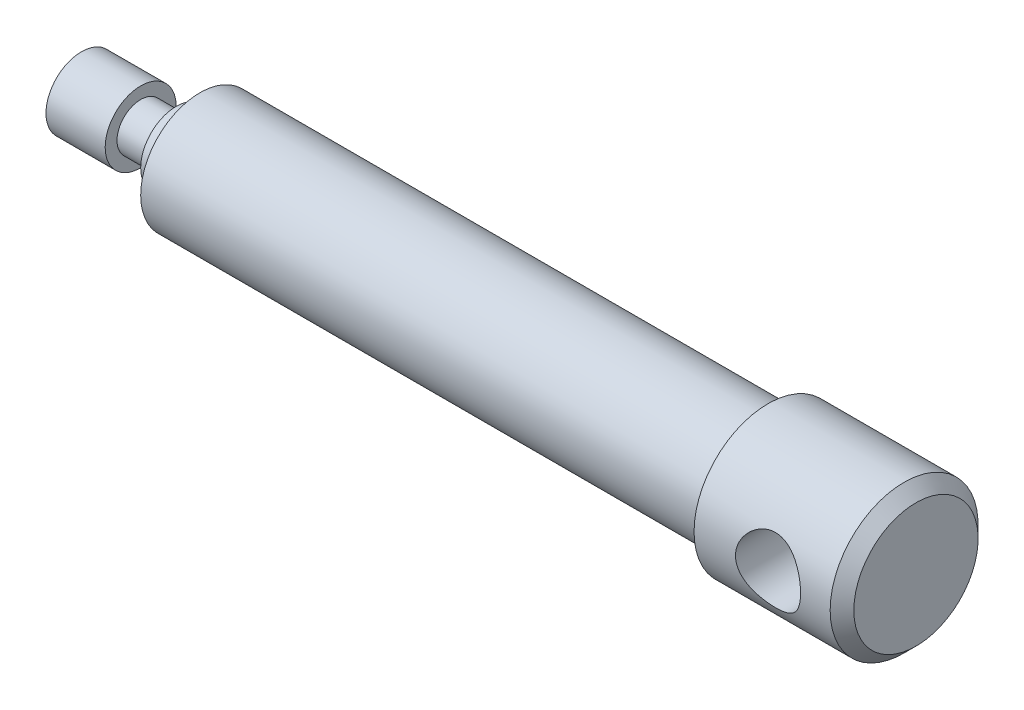
ISO-10303-21;
HEADER;
FILE_DESCRIPTION(('STEP AP214'),'2;1');
FILE_NAME('part.step','',(''),(''),'','','');
FILE_SCHEMA(('AUTOMOTIVE_DESIGN { 1 0 10303 214 1 1 1 1 }'));
ENDSEC;
DATA;
#1=APPLICATION_CONTEXT('core data for automotive mechanical design processes');
#2=APPLICATION_PROTOCOL_DEFINITION('international standard','automotive_design',2000,#1);
#3=PRODUCT_CONTEXT('',#1,'mechanical');
#4=PRODUCT('Part','Part','',(#3));
#5=PRODUCT_RELATED_PRODUCT_CATEGORY('part','',(#4));
#6=PRODUCT_DEFINITION_FORMATION('','',#4);
#7=PRODUCT_DEFINITION_CONTEXT('part definition',#1,'design');
#8=PRODUCT_DEFINITION('design','',#6,#7);
#9=PRODUCT_DEFINITION_SHAPE('','',#8);
#10=(LENGTH_UNIT() NAMED_UNIT(*) SI_UNIT(.MILLI.,.METRE.));
#11=(NAMED_UNIT(*) PLANE_ANGLE_UNIT() SI_UNIT($,.RADIAN.));
#12=(NAMED_UNIT(*) SI_UNIT($,.STERADIAN.) SOLID_ANGLE_UNIT());
#13=UNCERTAINTY_MEASURE_WITH_UNIT(LENGTH_MEASURE(1.E-05),#10,'distance_accuracy_value','');
#14=(GEOMETRIC_REPRESENTATION_CONTEXT(3) GLOBAL_UNCERTAINTY_ASSIGNED_CONTEXT((#13)) GLOBAL_UNIT_ASSIGNED_CONTEXT((#10,
#11,#12)) REPRESENTATION_CONTEXT('',''));
#15=CARTESIAN_POINT('',(0.,0.,0.));
#16=DIRECTION('',(0.,0.,1.));
#17=DIRECTION('',(1.,0.,0.));
#18=AXIS2_PLACEMENT_3D('',#15,#16,#17);
#19=CARTESIAN_POINT('',(0.,0.,0.));
#20=DIRECTION('',(-1.,0.,0.));
#21=DIRECTION('',(0.,0.,1.));
#22=AXIS2_PLACEMENT_3D('',#19,#20,#21);
#23=CYLINDRICAL_SURFACE('',#22,12.5);
#24=CARTESIAN_POINT('',(119.464101615138,0.,0.));
#25=DIRECTION('',(-1.,0.,0.));
#26=DIRECTION('',(0.,0.,1.));
#27=AXIS2_PLACEMENT_3D('',#24,#25,#26);
#28=CIRCLE('',#27,12.5);
#29=CARTESIAN_POINT('',(119.464101615138,0.,12.5));
#30=VERTEX_POINT('',#29);
#31=EDGE_CURVE('E99',#30,#30,#28,.T.);
#32=ORIENTED_EDGE('',*,*,#31,.F.);
#33=EDGE_LOOP('',(#32));
#34=FACE_BOUND('',#33,.T.);
#35=CARTESIAN_POINT('',(142.464101615138,0.,0.));
#36=DIRECTION('',(-1.,0.,0.));
#37=DIRECTION('',(0.,0.,1.));
#38=AXIS2_PLACEMENT_3D('',#35,#36,#37);
#39=CIRCLE('',#38,12.5);
#40=CARTESIAN_POINT('',(142.464101615138,0.,12.5));
#41=VERTEX_POINT('',#40);
#42=EDGE_CURVE('E102',#41,#41,#39,.T.);
#43=ORIENTED_EDGE('',*,*,#42,.T.);
#44=EDGE_LOOP('',(#43));
#45=FACE_BOUND('',#44,.T.);
#46=CARTESIAN_POINT('',(126.464101615138,0.,-12.5));
#47=CARTESIAN_POINT('',(126.464102710586,0.1466393829612,-12.4999990919958));
#48=CARTESIAN_POINT('',(126.46997382771,0.293318154375737,-12.4974127771437));
#49=CARTESIAN_POINT('',(126.493400866268,0.585621654571727,-12.4871317421033));
#50=CARTESIAN_POINT('',(126.510963580593,0.731245720812145,-12.4794340521813));
#51=CARTESIAN_POINT('',(126.557629487993,1.02057253620911,-12.4591130768074));
#52=CARTESIAN_POINT('',(126.586754615421,1.164271093875,-12.4464804302809));
#53=CARTESIAN_POINT('',(126.656249025637,1.44848793570787,-12.4166145150962));
#54=CARTESIAN_POINT('',(126.696622904921,1.58900489436773,-12.3993793658706));
#55=CARTESIAN_POINT('',(126.788034828349,1.86531961969119,-12.3608234307194));
#56=CARTESIAN_POINT('',(126.839029749022,2.00113395618487,-12.3395191942293));
#57=CARTESIAN_POINT('',(126.951321160079,2.26781794521038,-12.2933054447269));
#58=CARTESIAN_POINT('',(127.012621508405,2.39868572339156,-12.268394582024));
#59=CARTESIAN_POINT('',(127.21118193086,2.7825484085992,-12.1891528370919));
#60=CARTESIAN_POINT('',(127.363218839002,3.02715457986597,-12.1302614080197));
#61=CARTESIAN_POINT('',(127.71083829164,3.50004387600374,-12.0026174358568));
#62=CARTESIAN_POINT('',(127.908218222117,3.72689905043987,-11.9335190381105));
#63=CARTESIAN_POINT('',(128.337349318432,4.14565509209932,-11.7945843685197));
#64=CARTESIAN_POINT('',(128.569120426405,4.33753553398595,-11.7247476905427));
#65=CARTESIAN_POINT('',(128.945598422843,4.60042581643016,-11.6230643669958));
#66=CARTESIAN_POINT('',(129.079865632859,4.68578480105141,-11.5888235337291));
#67=CARTESIAN_POINT('',(129.355809318734,4.84480453726133,-11.5232483525484));
#68=CARTESIAN_POINT('',(129.497482670929,4.91847016863592,-11.4919127945086));
#69=CARTESIAN_POINT('',(129.78738031335,5.05346000363175,-11.4331958999344));
#70=CARTESIAN_POINT('',(129.935604672679,5.11478407703123,-11.4058146051242));
#71=CARTESIAN_POINT('',(130.237519500959,5.22443162315177,-11.3560091071692));
#72=CARTESIAN_POINT('',(130.391207001592,5.27276203714546,-11.3335822584827));
#73=CARTESIAN_POINT('',(130.694902704423,5.35374129664751,-11.2955457027421));
#74=CARTESIAN_POINT('',(130.844693334249,5.38706906362719,-11.2796446029338));
#75=CARTESIAN_POINT('',(131.146964637508,5.44112526743265,-11.2536686806615));
#76=CARTESIAN_POINT('',(131.299443988004,5.46185973185659,-11.2435910709824));
#77=CARTESIAN_POINT('',(131.605837310317,5.4904747555275,-11.2296456624185));
#78=CARTESIAN_POINT('',(131.759750786779,5.4983595988268,-11.2257757938851));
#79=CARTESIAN_POINT('',(132.067720103998,5.5011791640587,-11.2243945175479));
#80=CARTESIAN_POINT('',(132.221775935298,5.4961146920243,-11.226882713985));
#81=CARTESIAN_POINT('',(132.515220960375,5.474119295092,-11.2376219320427));
#82=CARTESIAN_POINT('',(132.654711916852,5.45826761109953,-11.2453486105443));
#83=CARTESIAN_POINT('',(132.93176363683,5.4160200853149,-11.2657568065911));
#84=CARTESIAN_POINT('',(133.069323760507,5.38962082992664,-11.2784399282011));
#85=CARTESIAN_POINT('',(133.341534835374,5.32655490299112,-11.3083610330218));
#86=CARTESIAN_POINT('',(133.476186380942,5.28989035098449,-11.3255980759142));
#87=CARTESIAN_POINT('',(133.741813948133,5.20664408045847,-11.364108068634));
#88=CARTESIAN_POINT('',(133.87278852341,5.16005851967099,-11.3853825817686));
#89=CARTESIAN_POINT('',(134.264701268995,5.0037345679706,-11.4553883060799));
#90=CARTESIAN_POINT('',(134.518779727427,4.87878948855267,-11.5096215236993));
#91=CARTESIAN_POINT('',(135.003291412298,4.59267512645533,-11.6267428833529));
#92=CARTESIAN_POINT('',(135.233714714887,4.43149073032543,-11.6896346321358));
#93=CARTESIAN_POINT('',(135.687642630506,4.05947526916122,-11.8242722566891));
#94=CARTESIAN_POINT('',(135.908396488443,3.84537725977205,-11.8962908236294));
#95=CARTESIAN_POINT('',(136.311915755141,3.38241134031741,-12.0360945955485));
#96=CARTESIAN_POINT('',(136.494670124743,3.13353336140135,-12.1038785663533));
#97=CARTESIAN_POINT('',(136.738609059208,2.73484422896275,-12.197955635025));
#98=CARTESIAN_POINT('',(136.815756922856,2.59555266683758,-12.2284231149523));
#99=CARTESIAN_POINT('',(136.957938787379,2.31018661039294,-12.2855264277796));
#100=CARTESIAN_POINT('',(137.022977763871,2.16411493302683,-12.312163833452));
#101=CARTESIAN_POINT('',(137.140276818167,1.8662354030683,-12.3608229376582));
#102=CARTESIAN_POINT('',(137.192540441266,1.71442915541157,-12.3828459165011));
#103=CARTESIAN_POINT('',(137.283726426954,1.40620435262902,-12.4216223606231));
#104=CARTESIAN_POINT('',(137.322649936817,1.24978619539295,-12.4383762790407));
#105=CARTESIAN_POINT('',(137.384470382644,0.944540398658058,-12.4651385183824));
#106=CARTESIAN_POINT('',(137.408286664443,0.795932182180471,-12.4755320320676));
#107=CARTESIAN_POINT('',(137.443667927657,0.496993254790936,-12.4910124588164));
#108=CARTESIAN_POINT('',(137.455233680739,0.346662652975809,-12.4960997061237));
#109=CARTESIAN_POINT('',(137.465976235274,0.0455158887639355,-12.500824024475));
#110=CARTESIAN_POINT('',(137.465156445322,-0.105300128619758,-12.5004625950366));
#111=CARTESIAN_POINT('',(137.451146014713,-0.406241968417485,-12.4943033507183));
#112=CARTESIAN_POINT('',(137.437955710413,-0.556367809486117,-12.4885056836515));
#113=CARTESIAN_POINT('',(137.40046249069,-0.846230612738631,-12.472119095482));
#114=CARTESIAN_POINT('',(137.376835411793,-0.986072215267389,-12.4618219233661));
#115=CARTESIAN_POINT('',(137.318952415438,-1.26317698191447,-12.4367900470452));
#116=CARTESIAN_POINT('',(137.284693061315,-1.40043929709517,-12.4220539080804));
#117=CARTESIAN_POINT('',(137.205880006866,-1.67142388581647,-12.3885014383697));
#118=CARTESIAN_POINT('',(137.16132927812,-1.8051471688349,-12.3696862855137));
#119=CARTESIAN_POINT('',(137.06232406367,-2.06831472251702,-12.3284167389751));
#120=CARTESIAN_POINT('',(137.007865799305,-2.19775733822886,-12.3059609571402));
#121=CARTESIAN_POINT('',(136.826598714625,-2.5863761110493,-12.232388936427));
#122=CARTESIAN_POINT('',(136.684305794027,-2.83756706974256,-12.1761319220311));
#123=CARTESIAN_POINT('',(136.363494460232,-3.31328248718942,-12.0553981561847));
#124=CARTESIAN_POINT('',(136.184960341077,-3.53779531725528,-11.9909178454989));
#125=CARTESIAN_POINT('',(135.780253921956,-3.97266163292821,-11.8542772885358));
#126=CARTESIAN_POINT('',(135.551429772227,-4.18048852552507,-11.7819130945979));
#127=CARTESIAN_POINT('',(135.06103985497,-4.55567668952968,-11.6419938703006));
#128=CARTESIAN_POINT('',(134.79946325634,-4.72302452075205,-11.5744404424892));
#129=CARTESIAN_POINT('',(134.384221764633,-4.94148703001358,-11.4820792572116));
#130=CARTESIAN_POINT('',(134.240253373886,-5.009449972063,-11.4525092108172));
#131=CARTESIAN_POINT('',(133.946275034955,-5.13287060587782,-11.3977278403932));
#132=CARTESIAN_POINT('',(133.796267786176,-5.18833381352247,-11.372514594946));
#133=CARTESIAN_POINT('',(133.491351642769,-5.28612668824464,-11.3273901888091));
#134=CARTESIAN_POINT('',(133.336445562102,-5.32846374941776,-11.3074760439801));
#135=CARTESIAN_POINT('',(133.022891456955,-5.39951781766007,-11.2737199274755));
#136=CARTESIAN_POINT('',(132.864243845424,-5.42823632048252,-11.2598772889668));
#137=CARTESIAN_POINT('',(132.557980477607,-5.46984065845161,-11.2397209947267));
#138=CARTESIAN_POINT('',(132.41055142798,-5.48384952593485,-11.232874598439));
#139=CARTESIAN_POINT('',(132.114891531558,-5.49992508511319,-11.2250125531146));
#140=CARTESIAN_POINT('',(131.966660734855,-5.50199251445712,-11.2239965439221));
#141=CARTESIAN_POINT('',(131.67062038249,-5.4941597364231,-11.227832683912));
#142=CARTESIAN_POINT('',(131.522810757127,-5.48426164027893,-11.2326837978814));
#143=CARTESIAN_POINT('',(131.228769021504,-5.45262810283324,-11.2480733680148));
#144=CARTESIAN_POINT('',(131.082536888792,-5.43089283022987,-11.2586117431263));
#145=CARTESIAN_POINT('',(130.801185353188,-5.37744521930291,-11.2842326244911));
#146=CARTESIAN_POINT('',(130.665914055672,-5.34638619955306,-11.2990154135121));
#147=CARTESIAN_POINT('',(130.398583024868,-5.27430996899172,-11.3328385293797));
#148=CARTESIAN_POINT('',(130.266524334477,-5.23328957069193,-11.3518802188548));
#149=CARTESIAN_POINT('',(129.876371762062,-5.09581073855199,-11.4145927043071));
#150=CARTESIAN_POINT('',(129.62411047283,-4.98489791759542,-11.4638695067249));
#151=CARTESIAN_POINT('',(129.125334465398,-4.71978063818501,-11.5756461915238));
#152=CARTESIAN_POINT('',(128.880203015111,-4.56327347711198,-11.6387872605327));
#153=CARTESIAN_POINT('',(128.418152148602,-4.21426117353747,-11.7696489403248));
#154=CARTESIAN_POINT('',(128.201244273024,-4.02174138338206,-11.83737140735));
#155=CARTESIAN_POINT('',(127.891914010791,-3.70026878178456,-11.9403590807349));
#156=CARTESIAN_POINT('',(127.787896176975,-3.58246341285297,-11.9763161086025));
#157=CARTESIAN_POINT('',(127.590130905244,-3.33812094520563,-12.046704354292));
#158=CARTESIAN_POINT('',(127.496379856808,-3.2115869417688,-12.0811361059547));
#159=CARTESIAN_POINT('',(127.319733042859,-2.9503778294293,-12.1475698075784));
#160=CARTESIAN_POINT('',(127.236847457193,-2.81569525633783,-12.1795694672867));
#161=CARTESIAN_POINT('',(127.082741276219,-2.53916491562744,-12.2402067919168));
#162=CARTESIAN_POINT('',(127.011515288347,-2.39732050030489,-12.2688460092976));
#163=CARTESIAN_POINT('',(126.882117522821,-2.10905276459765,-12.3216522174196));
#164=CARTESIAN_POINT('',(126.823801967513,-1.96270298577673,-12.3458678777071));
#165=CARTESIAN_POINT('',(126.719795435826,-1.66496318267278,-12.3895326281017));
#166=CARTESIAN_POINT('',(126.67409839623,-1.51357561837443,-12.4089840069441));
#167=CARTESIAN_POINT('',(126.595908559158,-1.20724269501744,-12.4425179160448));
#168=CARTESIAN_POINT('',(126.563384026286,-1.05230684852084,-12.4566133448073));
#169=CARTESIAN_POINT('',(126.511797738458,-0.739877601012899,-12.47906540951));
#170=CARTESIAN_POINT('',(126.492726544615,-0.582386072594339,-12.4874260688604));
#171=CARTESIAN_POINT('',(126.475033312024,-0.353758373712979,-12.4951932059168));
#172=CARTESIAN_POINT('',(126.470935442423,-0.283084907503942,-12.4969943952127));
#173=CARTESIAN_POINT('',(126.46546931583,-0.141610689878754,-12.4993980174853));
#174=CARTESIAN_POINT('',(126.464101086163,-0.0708099371954954,-12.5000004384615));
#175=CARTESIAN_POINT('',(126.464101615138,0.,-12.5));
#176=B_SPLINE_CURVE_WITH_KNOTS('',3,(#46,#47,#48,#49,#50,#51,#52,#53,#54,#55,#56,#57,#58,#59,
#60,#61,#62,#63,#64,#65,#66,#67,#68,#69,#70,#71,#72,#73,#74,#75,#76,#77,#78,#79,#80,#81,#82,#83,
#84,#85,#86,#87,#88,#89,#90,#91,#92,#93,#94,#95,#96,#97,#98,#99,#100,#101,#102,#103,#104,#105,
#106,#107,#108,#109,#110,#111,#112,#113,#114,#115,#116,#117,#118,#119,#120,#121,#122,#123,#124,
#125,#126,#127,#128,#129,#130,#131,#132,#133,#134,#135,#136,#137,#138,#139,#140,#141,#142,#143,
#144,#145,#146,#147,#148,#149,#150,#151,#152,#153,#154,#155,#156,#157,#158,#159,#160,#161,#162,
#163,#164,#165,#166,#167,#168,#169,#170,#171,#172,#173,#174,#175),.UNSPECIFIED.,.T.,.F.,(4,2,2,
2,2,2,2,2,2,2,2,2,2,2,2,2,2,2,2,2,2,2,2,2,2,2,2,2,2,2,2,2,2,2,2,2,2,2,2,2,2,2,2,2,2,2,2,2,2,2,2,
2,2,2,2,2,2,2,2,2,2,2,2,2,4),(0.,0.439846896635049,0.879949570329764,1.32089115648199,
1.76201318631245,2.20137792196695,2.64090750604863,3.51885611338796,4.44070823623365,
5.36309701021097,5.85082579480169,6.33835050578058,6.82588036059961,7.31314925488693,
7.77534632926128,8.23732200514071,8.69914362720417,9.16093650377828,9.58224460334831,
10.0036891648678,10.4250467721589,10.846567863096,11.7075328574956,12.568857581862,
13.5122441651813,14.4559044282287,14.9417259055645,15.4273473130978,15.9128338021932,
16.3982785280879,16.8502809850182,17.3022549684301,17.7541045674197,18.2059418808202,
18.632040140267,19.0582762709278,19.4843894816696,19.9106655508824,20.7889739925331,
21.6676638851105,22.6158909492907,23.5644324206488,24.0496707619814,24.5346945563763,
25.0194446332887,25.5041414568012,25.9483117471379,26.3924545998085,26.8365190979981,
27.2805772677448,27.6988256690068,28.1172080800988,28.9533936994914,29.8427032161917,
30.7323752372297,31.2155464216097,31.6985471398147,32.181997195314,32.6652230195463,
33.1427614141818,33.6200699499874,34.0962216068892,34.5720388618025,34.7844321405896,
34.9968275455444),.UNSPECIFIED.);
#177=CARTESIAN_POINT('',(126.464101615138,0.,-12.5));
#178=VERTEX_POINT('',#177);
#179=EDGE_CURVE('E49',#178,#178,#176,.T.);
#180=ORIENTED_EDGE('',*,*,#179,.F.);
#181=EDGE_LOOP('',(#180));
#182=FACE_BOUND('',#181,.T.);
#183=CARTESIAN_POINT('',(126.464101615138,0.,12.5));
#184=CARTESIAN_POINT('',(126.464102710586,-0.1466393829612,12.4999990919958));
#185=CARTESIAN_POINT('',(126.46997382771,-0.293318154375737,12.4974127771437));
#186=CARTESIAN_POINT('',(126.493400866268,-0.585621654571727,12.4871317421033));
#187=CARTESIAN_POINT('',(126.510963580593,-0.731245720812145,12.4794340521813));
#188=CARTESIAN_POINT('',(126.557629487993,-1.02057253620911,12.4591130768074));
#189=CARTESIAN_POINT('',(126.586754615421,-1.164271093875,12.4464804302809));
#190=CARTESIAN_POINT('',(126.656249025637,-1.44848793570787,12.4166145150962));
#191=CARTESIAN_POINT('',(126.696622904921,-1.58900489436773,12.3993793658706));
#192=CARTESIAN_POINT('',(126.788034828349,-1.86531961969119,12.3608234307194));
#193=CARTESIAN_POINT('',(126.839029749022,-2.00113395618486,12.3395191942293));
#194=CARTESIAN_POINT('',(126.951321160079,-2.26781794521036,12.2933054447269));
#195=CARTESIAN_POINT('',(127.012621508405,-2.39868572339154,12.268394582024));
#196=CARTESIAN_POINT('',(127.21118193086,-2.7825484085992,12.1891528370919));
#197=CARTESIAN_POINT('',(127.363218839002,-3.02715457986596,12.1302614080197));
#198=CARTESIAN_POINT('',(127.71083829164,-3.50004387600374,12.0026174358568));
#199=CARTESIAN_POINT('',(127.908218222117,-3.72689905043987,11.9335190381105));
#200=CARTESIAN_POINT('',(128.337349318432,-4.14565509209933,11.7945843685197));
#201=CARTESIAN_POINT('',(128.569120426405,-4.33753553398595,11.7247476905427));
#202=CARTESIAN_POINT('',(128.945598422843,-4.60042581643016,11.6230643669958));
#203=CARTESIAN_POINT('',(129.079865632859,-4.68578480105141,11.5888235337291));
#204=CARTESIAN_POINT('',(129.355809318734,-4.84480453726133,11.5232483525484));
#205=CARTESIAN_POINT('',(129.497482670929,-4.91847016863592,11.4919127945086));
#206=CARTESIAN_POINT('',(129.78738031335,-5.05346000363175,11.4331958999344));
#207=CARTESIAN_POINT('',(129.935604672679,-5.11478407703123,11.4058146051242));
#208=CARTESIAN_POINT('',(130.237519500959,-5.22443162315177,11.3560091071692));
#209=CARTESIAN_POINT('',(130.391207001592,-5.27276203714546,11.3335822584827));
#210=CARTESIAN_POINT('',(130.694902704423,-5.35374129664751,11.2955457027421));
#211=CARTESIAN_POINT('',(130.844693334249,-5.38706906362719,11.2796446029338));
#212=CARTESIAN_POINT('',(131.146964637508,-5.44112526743265,11.2536686806615));
#213=CARTESIAN_POINT('',(131.299443988004,-5.46185973185659,11.2435910709824));
#214=CARTESIAN_POINT('',(131.605837310317,-5.4904747555275,11.2296456624185));
#215=CARTESIAN_POINT('',(131.759750786779,-5.4983595988268,11.2257757938851));
#216=CARTESIAN_POINT('',(132.067720103998,-5.5011791640587,11.2243945175479));
#217=CARTESIAN_POINT('',(132.221775935298,-5.4961146920243,11.226882713985));
#218=CARTESIAN_POINT('',(132.515220960375,-5.474119295092,11.2376219320427));
#219=CARTESIAN_POINT('',(132.654711916852,-5.45826761109953,11.2453486105443));
#220=CARTESIAN_POINT('',(132.93176363683,-5.4160200853149,11.2657568065911));
#221=CARTESIAN_POINT('',(133.069323760507,-5.38962082992664,11.2784399282011));
#222=CARTESIAN_POINT('',(133.341534835374,-5.32655490299112,11.3083610330218));
#223=CARTESIAN_POINT('',(133.476186380942,-5.28989035098449,11.3255980759142));
#224=CARTESIAN_POINT('',(133.741813948133,-5.20664408045847,11.364108068634));
#225=CARTESIAN_POINT('',(133.87278852341,-5.16005851967099,11.3853825817686));
#226=CARTESIAN_POINT('',(134.264701268995,-5.0037345679706,11.4553883060799));
#227=CARTESIAN_POINT('',(134.518779727427,-4.87878948855267,11.5096215236993));
#228=CARTESIAN_POINT('',(135.003291412298,-4.59267512645533,11.6267428833529));
#229=CARTESIAN_POINT('',(135.233714714887,-4.43149073032543,11.6896346321358));
#230=CARTESIAN_POINT('',(135.687642630506,-4.05947526916122,11.8242722566891));
#231=CARTESIAN_POINT('',(135.908396488443,-3.84537725977205,11.8962908236294));
#232=CARTESIAN_POINT('',(136.311915755141,-3.38241134031741,12.0360945955485));
#233=CARTESIAN_POINT('',(136.494670124743,-3.13353336140135,12.1038785663533));
#234=CARTESIAN_POINT('',(136.738609059208,-2.73484422896274,12.197955635025));
#235=CARTESIAN_POINT('',(136.815756922856,-2.59555266683758,12.2284231149523));
#236=CARTESIAN_POINT('',(136.957938787379,-2.31018661039293,12.2855264277796));
#237=CARTESIAN_POINT('',(137.022977763871,-2.16411493302683,12.312163833452));
#238=CARTESIAN_POINT('',(137.140276818167,-1.8662354030683,12.3608229376582));
#239=CARTESIAN_POINT('',(137.192540441266,-1.71442915541157,12.3828459165011));
#240=CARTESIAN_POINT('',(137.283726426954,-1.40620435262902,12.4216223606231));
#241=CARTESIAN_POINT('',(137.322649936817,-1.24978619539295,12.4383762790407));
#242=CARTESIAN_POINT('',(137.384470382644,-0.944540398658058,12.4651385183824));
#243=CARTESIAN_POINT('',(137.408286664443,-0.795932182180471,12.4755320320676));
#244=CARTESIAN_POINT('',(137.443667927657,-0.496993254790936,12.4910124588164));
#245=CARTESIAN_POINT('',(137.455233680739,-0.346662652975809,12.4960997061237));
#246=CARTESIAN_POINT('',(137.465976235274,-0.0455158887639355,12.500824024475));
#247=CARTESIAN_POINT('',(137.465156445322,0.105300128619758,12.5004625950366));
#248=CARTESIAN_POINT('',(137.451146014713,0.406241968417485,12.4943033507183));
#249=CARTESIAN_POINT('',(137.437955710413,0.556367809486117,12.4885056836515));
#250=CARTESIAN_POINT('',(137.40046249069,0.846230612738631,12.472119095482));
#251=CARTESIAN_POINT('',(137.376835411793,0.986072215267389,12.4618219233661));
#252=CARTESIAN_POINT('',(137.318952415438,1.26317698191447,12.4367900470452));
#253=CARTESIAN_POINT('',(137.284693061315,1.40043929709517,12.4220539080804));
#254=CARTESIAN_POINT('',(137.205880006866,1.67142388581647,12.3885014383697));
#255=CARTESIAN_POINT('',(137.16132927812,1.8051471688349,12.3696862855137));
#256=CARTESIAN_POINT('',(137.06232406367,2.06831472251702,12.3284167389751));
#257=CARTESIAN_POINT('',(137.007865799305,2.19775733822886,12.3059609571402));
#258=CARTESIAN_POINT('',(136.826598714625,2.5863761110493,12.232388936427));
#259=CARTESIAN_POINT('',(136.684305794027,2.83756706974256,12.1761319220311));
#260=CARTESIAN_POINT('',(136.363494460232,3.31328248718942,12.0553981561847));
#261=CARTESIAN_POINT('',(136.184960341077,3.53779531725528,11.9909178454989));
#262=CARTESIAN_POINT('',(135.780253921956,3.97266163292821,11.8542772885358));
#263=CARTESIAN_POINT('',(135.551429772227,4.18048852552507,11.7819130945979));
#264=CARTESIAN_POINT('',(135.06103985497,4.55567668952968,11.6419938703006));
#265=CARTESIAN_POINT('',(134.79946325634,4.72302452075205,11.5744404424892));
#266=CARTESIAN_POINT('',(134.384221764633,4.94148703001358,11.4820792572116));
#267=CARTESIAN_POINT('',(134.240253373886,5.009449972063,11.4525092108172));
#268=CARTESIAN_POINT('',(133.946275034955,5.13287060587782,11.3977278403932));
#269=CARTESIAN_POINT('',(133.796267786176,5.18833381352247,11.372514594946));
#270=CARTESIAN_POINT('',(133.491351642769,5.28612668824464,11.3273901888091));
#271=CARTESIAN_POINT('',(133.336445562102,5.32846374941776,11.3074760439801));
#272=CARTESIAN_POINT('',(133.022891456955,5.39951781766007,11.2737199274755));
#273=CARTESIAN_POINT('',(132.864243845424,5.42823632048252,11.2598772889668));
#274=CARTESIAN_POINT('',(132.557980477607,5.46984065845161,11.2397209947267));
#275=CARTESIAN_POINT('',(132.41055142798,5.48384952593485,11.232874598439));
#276=CARTESIAN_POINT('',(132.114891531558,5.49992508511319,11.2250125531146));
#277=CARTESIAN_POINT('',(131.966660734855,5.50199251445712,11.2239965439221));
#278=CARTESIAN_POINT('',(131.67062038249,5.4941597364231,11.227832683912));
#279=CARTESIAN_POINT('',(131.522810757127,5.48426164027893,11.2326837978814));
#280=CARTESIAN_POINT('',(131.228769021504,5.45262810283324,11.2480733680148));
#281=CARTESIAN_POINT('',(131.082536888792,5.43089283022987,11.2586117431263));
#282=CARTESIAN_POINT('',(130.801185353188,5.37744521930291,11.2842326244911));
#283=CARTESIAN_POINT('',(130.665914055672,5.34638619955306,11.2990154135121));
#284=CARTESIAN_POINT('',(130.398583024868,5.27430996899172,11.3328385293797));
#285=CARTESIAN_POINT('',(130.266524334477,5.23328957069193,11.3518802188548));
#286=CARTESIAN_POINT('',(129.876371762062,5.09581073855199,11.4145927043071));
#287=CARTESIAN_POINT('',(129.62411047283,4.98489791759542,11.4638695067249));
#288=CARTESIAN_POINT('',(129.125334465398,4.71978063818501,11.5756461915238));
#289=CARTESIAN_POINT('',(128.880203015111,4.56327347711198,11.6387872605327));
#290=CARTESIAN_POINT('',(128.418152148602,4.21426117353747,11.7696489403248));
#291=CARTESIAN_POINT('',(128.201244273024,4.02174138338206,11.83737140735));
#292=CARTESIAN_POINT('',(127.891914010791,3.70026878178456,11.9403590807349));
#293=CARTESIAN_POINT('',(127.787896176975,3.58246341285297,11.9763161086025));
#294=CARTESIAN_POINT('',(127.590130905244,3.33812094520562,12.046704354292));
#295=CARTESIAN_POINT('',(127.496379856808,3.2115869417688,12.0811361059547));
#296=CARTESIAN_POINT('',(127.319733042859,2.9503778294293,12.1475698075784));
#297=CARTESIAN_POINT('',(127.236847457193,2.81569525633783,12.1795694672867));
#298=CARTESIAN_POINT('',(127.082741276219,2.53916491562744,12.2402067919168));
#299=CARTESIAN_POINT('',(127.011515288347,2.39732050030489,12.2688460092976));
#300=CARTESIAN_POINT('',(126.882117522821,2.10905276459764,12.3216522174196));
#301=CARTESIAN_POINT('',(126.823801967513,1.96270298577673,12.3458678777071));
#302=CARTESIAN_POINT('',(126.719795435826,1.66496318267278,12.3895326281017));
#303=CARTESIAN_POINT('',(126.67409839623,1.51357561837443,12.4089840069441));
#304=CARTESIAN_POINT('',(126.595908559158,1.20724269501744,12.4425179160448));
#305=CARTESIAN_POINT('',(126.563384026286,1.05230684852084,12.4566133448073));
#306=CARTESIAN_POINT('',(126.511797738458,0.739877601012898,12.47906540951));
#307=CARTESIAN_POINT('',(126.492726544615,0.582386072594339,12.4874260688604));
#308=CARTESIAN_POINT('',(126.475033312024,0.353758373712979,12.4951932059168));
#309=CARTESIAN_POINT('',(126.470935442423,0.283084907503942,12.4969943952127));
#310=CARTESIAN_POINT('',(126.46546931583,0.141610689878754,12.4993980174853));
#311=CARTESIAN_POINT('',(126.464101086163,0.0708099371954955,12.5000004384615));
#312=CARTESIAN_POINT('',(126.464101615138,0.,12.5));
#313=B_SPLINE_CURVE_WITH_KNOTS('',3,(#183,#184,#185,#186,#187,#188,#189,#190,#191,#192,#193,
#194,#195,#196,#197,#198,#199,#200,#201,#202,#203,#204,#205,#206,#207,#208,#209,#210,#211,#212,
#213,#214,#215,#216,#217,#218,#219,#220,#221,#222,#223,#224,#225,#226,#227,#228,#229,#230,#231,
#232,#233,#234,#235,#236,#237,#238,#239,#240,#241,#242,#243,#244,#245,#246,#247,#248,#249,#250,
#251,#252,#253,#254,#255,#256,#257,#258,#259,#260,#261,#262,#263,#264,#265,#266,#267,#268,#269,
#270,#271,#272,#273,#274,#275,#276,#277,#278,#279,#280,#281,#282,#283,#284,#285,#286,#287,#288,
#289,#290,#291,#292,#293,#294,#295,#296,#297,#298,#299,#300,#301,#302,#303,#304,#305,#306,#307,
#308,#309,#310,#311,#312),.UNSPECIFIED.,.T.,.F.,(4,2,2,2,2,2,2,2,2,2,2,2,2,2,2,2,2,2,2,2,2,2,2,
2,2,2,2,2,2,2,2,2,2,2,2,2,2,2,2,2,2,2,2,2,2,2,2,2,2,2,2,2,2,2,2,2,2,2,2,2,2,2,2,2,4),(0.,
0.439846896635049,0.879949570329764,1.32089115648199,1.76201318631245,2.20137792196694,
2.64090750604859,3.51885611338796,4.44070823623365,5.36309701021097,5.85082579480169,
6.33835050578058,6.82588036059961,7.31314925488693,7.77534632926128,8.23732200514071,
8.69914362720419,9.16093650377828,9.58224460334831,10.0036891648678,10.4250467721589,
10.846567863096,11.7075328574956,12.568857581862,13.5122441651813,14.4559044282287,
14.9417259055645,15.4273473130978,15.9128338021932,16.3982785280879,16.8502809850182,
17.3022549684301,17.7541045674197,18.2059418808202,18.632040140267,19.0582762709278,
19.4843894816696,19.9106655508824,20.7889739925331,21.6676638851105,22.6158909492907,
23.5644324206488,24.0496707619814,24.5346945563763,25.0194446332887,25.5041414568012,
25.9483117471379,26.3924545998085,26.8365190979981,27.2805772677448,27.6988256690068,
28.1172080800989,28.9533936994914,29.8427032161917,30.7323752372297,31.2155464216097,
31.6985471398147,32.181997195314,32.6652230195463,33.1427614141818,33.6200699499874,
34.0962216068892,34.5720388618025,34.7844321405896,34.9968275455444),.UNSPECIFIED.);
#314=CARTESIAN_POINT('',(126.464101615138,0.,12.5));
#315=VERTEX_POINT('',#314);
#316=EDGE_CURVE('E11',#315,#315,#313,.T.);
#317=ORIENTED_EDGE('',*,*,#316,.F.);
#318=EDGE_LOOP('',(#317));
#319=FACE_BOUND('',#318,.T.);
#320=ADVANCED_FACE('F37',(#34,#45,#182,#319),#23,.T.);
#321=CARTESIAN_POINT('',(3.46410161513774,0.,0.));
#322=DIRECTION('',(1.,0.,0.));
#323=DIRECTION('',(0.,0.,-1.));
#324=AXIS2_PLACEMENT_3D('',#321,#322,#323);
#325=CONICAL_SURFACE('',#324,6.,1.0471975511966);
#326=CARTESIAN_POINT('',(0.,0.,0.));
#327=VERTEX_POINT('',#326);
#328=VERTEX_LOOP('',#327);
#329=FACE_BOUND('',#328,.T.);
#330=CARTESIAN_POINT('',(3.46410161513774,0.,0.));
#331=DIRECTION('',(-1.,0.,0.));
#332=DIRECTION('',(0.,0.,1.));
#333=AXIS2_PLACEMENT_3D('',#330,#331,#332);
#334=CIRCLE('',#333,6.);
#335=CARTESIAN_POINT('',(3.46410161513774,0.,6.));
#336=VERTEX_POINT('',#335);
#337=EDGE_CURVE('E57',#336,#336,#334,.T.);
#338=ORIENTED_EDGE('',*,*,#337,.T.);
#339=EDGE_LOOP('',(#338));
#340=FACE_BOUND('',#339,.T.);
#341=ADVANCED_FACE('F39',(#329,#340),#325,.T.);
#342=CARTESIAN_POINT('',(0.,0.,0.));
#343=DIRECTION('',(-1.,0.,0.));
#344=DIRECTION('',(0.,0.,1.));
#345=AXIS2_PLACEMENT_3D('',#342,#343,#344);
#346=CYLINDRICAL_SURFACE('',#345,6.);
#347=ORIENTED_EDGE('',*,*,#337,.F.);
#348=EDGE_LOOP('',(#347));
#349=FACE_BOUND('',#348,.T.);
#350=CARTESIAN_POINT('',(13.4641016151377,0.,0.));
#351=DIRECTION('',(-1.,0.,0.));
#352=DIRECTION('',(0.,0.,1.));
#353=AXIS2_PLACEMENT_3D('',#350,#351,#352);
#354=CIRCLE('',#353,6.);
#355=CARTESIAN_POINT('',(13.4641016151377,0.,6.));
#356=VERTEX_POINT('',#355);
#357=EDGE_CURVE('E59',#356,#356,#354,.T.);
#358=ORIENTED_EDGE('',*,*,#357,.T.);
#359=EDGE_LOOP('',(#358));
#360=FACE_BOUND('',#359,.T.);
#361=ADVANCED_FACE('F54',(#349,#360),#346,.T.);
#362=CARTESIAN_POINT('',(13.4641016151377,6.,0.));
#363=DIRECTION('',(-1.,0.,0.));
#364=DIRECTION('',(0.,0.,1.));
#365=AXIS2_PLACEMENT_3D('',#362,#363,#364);
#366=PLANE('',#365);
#367=ORIENTED_EDGE('',*,*,#357,.F.);
#368=EDGE_LOOP('',(#367));
#369=FACE_BOUND('',#368,.T.);
#370=CARTESIAN_POINT('',(13.4641016151377,0.,0.));
#371=DIRECTION('',(-1.,0.,0.));
#372=DIRECTION('',(0.,0.,1.));
#373=AXIS2_PLACEMENT_3D('',#370,#371,#372);
#374=CIRCLE('',#373,4.);
#375=CARTESIAN_POINT('',(13.4641016151377,0.,4.));
#376=VERTEX_POINT('',#375);
#377=EDGE_CURVE('E63',#376,#376,#374,.T.);
#378=ORIENTED_EDGE('',*,*,#377,.T.);
#379=EDGE_LOOP('',(#378));
#380=FACE_BOUND('',#379,.T.);
#381=ADVANCED_FACE('F130',(#369,#380),#366,.F.);
#382=CARTESIAN_POINT('',(0.,0.,0.));
#383=DIRECTION('',(-1.,0.,0.));
#384=DIRECTION('',(0.,0.,1.));
#385=AXIS2_PLACEMENT_3D('',#382,#383,#384);
#386=CYLINDRICAL_SURFACE('',#385,4.);
#387=ORIENTED_EDGE('',*,*,#377,.F.);
#388=EDGE_LOOP('',(#387));
#389=FACE_BOUND('',#388,.T.);
#390=CARTESIAN_POINT('',(19.4641016151377,0.,0.));
#391=DIRECTION('',(-1.,0.,0.));
#392=DIRECTION('',(0.,0.,1.));
#393=AXIS2_PLACEMENT_3D('',#390,#391,#392);
#394=CIRCLE('',#393,4.);
#395=CARTESIAN_POINT('',(19.4641016151377,0.,4.));
#396=VERTEX_POINT('',#395);
#397=EDGE_CURVE('E125',#396,#396,#394,.T.);
#398=ORIENTED_EDGE('',*,*,#397,.T.);
#399=EDGE_LOOP('',(#398));
#400=FACE_BOUND('',#399,.T.);
#401=ADVANCED_FACE('F132',(#389,#400),#386,.T.);
#402=CARTESIAN_POINT('',(19.4641016151377,4.,0.));
#403=DIRECTION('',(1.,0.,0.));
#404=DIRECTION('',(0.,0.,-1.));
#405=AXIS2_PLACEMENT_3D('',#402,#403,#404);
#406=PLANE('',#405);
#407=ORIENTED_EDGE('',*,*,#397,.F.);
#408=EDGE_LOOP('',(#407));
#409=FACE_BOUND('',#408,.T.);
#410=CARTESIAN_POINT('',(19.4641016151377,0.,0.));
#411=DIRECTION('',(-1.,0.,0.));
#412=DIRECTION('',(0.,0.,1.));
#413=AXIS2_PLACEMENT_3D('',#410,#411,#412);
#414=CIRCLE('',#413,6.);
#415=CARTESIAN_POINT('',(19.4641016151377,0.,6.));
#416=VERTEX_POINT('',#415);
#417=EDGE_CURVE('E122',#416,#416,#414,.T.);
#418=ORIENTED_EDGE('',*,*,#417,.T.);
#419=EDGE_LOOP('',(#418));
#420=FACE_BOUND('',#419,.T.);
#421=ADVANCED_FACE('F135',(#409,#420),#406,.F.);
#422=CARTESIAN_POINT('',(0.,0.,0.));
#423=DIRECTION('',(-1.,0.,0.));
#424=DIRECTION('',(0.,0.,1.));
#425=AXIS2_PLACEMENT_3D('',#422,#423,#424);
#426=CYLINDRICAL_SURFACE('',#425,6.);
#427=ORIENTED_EDGE('',*,*,#417,.F.);
#428=EDGE_LOOP('',(#427));
#429=FACE_BOUND('',#428,.T.);
#430=CARTESIAN_POINT('',(23.4641016151377,0.,0.));
#431=DIRECTION('',(-1.,0.,0.));
#432=DIRECTION('',(0.,0.,1.));
#433=AXIS2_PLACEMENT_3D('',#430,#431,#432);
#434=CIRCLE('',#433,6.);
#435=CARTESIAN_POINT('',(23.4641016151377,0.,6.));
#436=VERTEX_POINT('',#435);
#437=EDGE_CURVE('E119',#436,#436,#434,.T.);
#438=ORIENTED_EDGE('',*,*,#437,.T.);
#439=EDGE_LOOP('',(#438));
#440=FACE_BOUND('',#439,.T.);
#441=ADVANCED_FACE('F141',(#429,#440),#426,.T.);
#442=CARTESIAN_POINT('',(23.4641016151377,6.,0.));
#443=DIRECTION('',(1.,0.,0.));
#444=DIRECTION('',(0.,0.,-1.));
#445=AXIS2_PLACEMENT_3D('',#442,#443,#444);
#446=PLANE('',#445);
#447=ORIENTED_EDGE('',*,*,#437,.F.);
#448=EDGE_LOOP('',(#447));
#449=FACE_BOUND('',#448,.T.);
#450=CARTESIAN_POINT('',(23.4641016151377,0.,0.));
#451=DIRECTION('',(-1.,0.,0.));
#452=DIRECTION('',(0.,0.,1.));
#453=AXIS2_PLACEMENT_3D('',#450,#451,#452);
#454=CIRCLE('',#453,10.);
#455=CARTESIAN_POINT('',(23.4641016151377,0.,10.));
#456=VERTEX_POINT('',#455);
#457=EDGE_CURVE('E116',#456,#456,#454,.T.);
#458=ORIENTED_EDGE('',*,*,#457,.T.);
#459=EDGE_LOOP('',(#458));
#460=FACE_BOUND('',#459,.T.);
#461=ADVANCED_FACE('F147',(#449,#460),#446,.F.);
#462=CARTESIAN_POINT('',(0.,0.,0.));
#463=DIRECTION('',(-1.,0.,0.));
#464=DIRECTION('',(0.,0.,1.));
#465=AXIS2_PLACEMENT_3D('',#462,#463,#464);
#466=CYLINDRICAL_SURFACE('',#465,10.);
#467=ORIENTED_EDGE('',*,*,#457,.F.);
#468=EDGE_LOOP('',(#467));
#469=FACE_BOUND('',#468,.T.);
#470=CARTESIAN_POINT('',(119.464101615138,0.,0.));
#471=DIRECTION('',(-1.,0.,0.));
#472=DIRECTION('',(0.,0.,1.));
#473=AXIS2_PLACEMENT_3D('',#470,#471,#472);
#474=CIRCLE('',#473,10.);
#475=CARTESIAN_POINT('',(119.464101615138,0.,10.));
#476=VERTEX_POINT('',#475);
#477=EDGE_CURVE('E109',#476,#476,#474,.T.);
#478=ORIENTED_EDGE('',*,*,#477,.T.);
#479=EDGE_LOOP('',(#478));
#480=FACE_BOUND('',#479,.T.);
#481=ADVANCED_FACE('F88',(#469,#480),#466,.T.);
#482=CARTESIAN_POINT('',(119.464101615138,10.,0.));
#483=DIRECTION('',(1.,0.,0.));
#484=DIRECTION('',(0.,0.,-1.));
#485=AXIS2_PLACEMENT_3D('',#482,#483,#484);
#486=PLANE('',#485);
#487=ORIENTED_EDGE('',*,*,#477,.F.);
#488=EDGE_LOOP('',(#487));
#489=FACE_BOUND('',#488,.T.);
#490=ORIENTED_EDGE('',*,*,#31,.T.);
#491=EDGE_LOOP('',(#490));
#492=FACE_BOUND('',#491,.T.);
#493=ADVANCED_FACE('F83',(#489,#492),#486,.F.);
#494=CARTESIAN_POINT('',(144.464101615138,0.,0.));
#495=DIRECTION('',(-1.,0.,0.));
#496=DIRECTION('',(0.,0.,1.));
#497=AXIS2_PLACEMENT_3D('',#494,#495,#496);
#498=CONICAL_SURFACE('',#497,10.5,0.785398163397446);
#499=ORIENTED_EDGE('',*,*,#42,.F.);
#500=EDGE_LOOP('',(#499));
#501=FACE_BOUND('',#500,.T.);
#502=CARTESIAN_POINT('',(144.464101615138,0.,0.));
#503=DIRECTION('',(-1.,0.,0.));
#504=DIRECTION('',(0.,0.,1.));
#505=AXIS2_PLACEMENT_3D('',#502,#503,#504);
#506=CIRCLE('',#505,10.5);
#507=CARTESIAN_POINT('',(144.464101615138,0.,10.5));
#508=VERTEX_POINT('',#507);
#509=EDGE_CURVE('E107',#508,#508,#506,.T.);
#510=ORIENTED_EDGE('',*,*,#509,.T.);
#511=EDGE_LOOP('',(#510));
#512=FACE_BOUND('',#511,.T.);
#513=ADVANCED_FACE('F80',(#501,#512),#498,.T.);
#514=CARTESIAN_POINT('',(144.464101615138,10.5,0.));
#515=DIRECTION('',(-1.,0.,0.));
#516=DIRECTION('',(0.,0.,1.));
#517=AXIS2_PLACEMENT_3D('',#514,#515,#516);
#518=PLANE('',#517);
#519=ORIENTED_EDGE('',*,*,#509,.F.);
#520=EDGE_LOOP('',(#519));
#521=FACE_BOUND('',#520,.T.);
#522=ADVANCED_FACE('F76',(#521),#518,.F.);
#523=CARTESIAN_POINT('',(131.964101615138,0.,12.5));
#524=DIRECTION('',(0.,0.,-1.));
#525=DIRECTION('',(-1.,0.,0.));
#526=AXIS2_PLACEMENT_3D('',#523,#524,#525);
#527=CYLINDRICAL_SURFACE('',#526,5.50000000000002);
#528=ORIENTED_EDGE('',*,*,#179,.T.);
#529=EDGE_LOOP('',(#528));
#530=FACE_BOUND('',#529,.T.);
#531=ORIENTED_EDGE('',*,*,#316,.T.);
#532=EDGE_LOOP('',(#531));
#533=FACE_BOUND('',#532,.T.);
#534=ADVANCED_FACE('F72',(#530,#533),#527,.F.);
#535=CLOSED_SHELL('',(#320,#341,#361,#381,#401,#421,#441,#461,#481,#493,#513,#522,#534));
#536=MANIFOLD_SOLID_BREP('B2',#535);
#537=ADVANCED_BREP_SHAPE_REPRESENTATION('',(#18,#536),#14);
#538=SHAPE_DEFINITION_REPRESENTATION(#9,#537);
ENDSEC;
END-ISO-10303-21;
